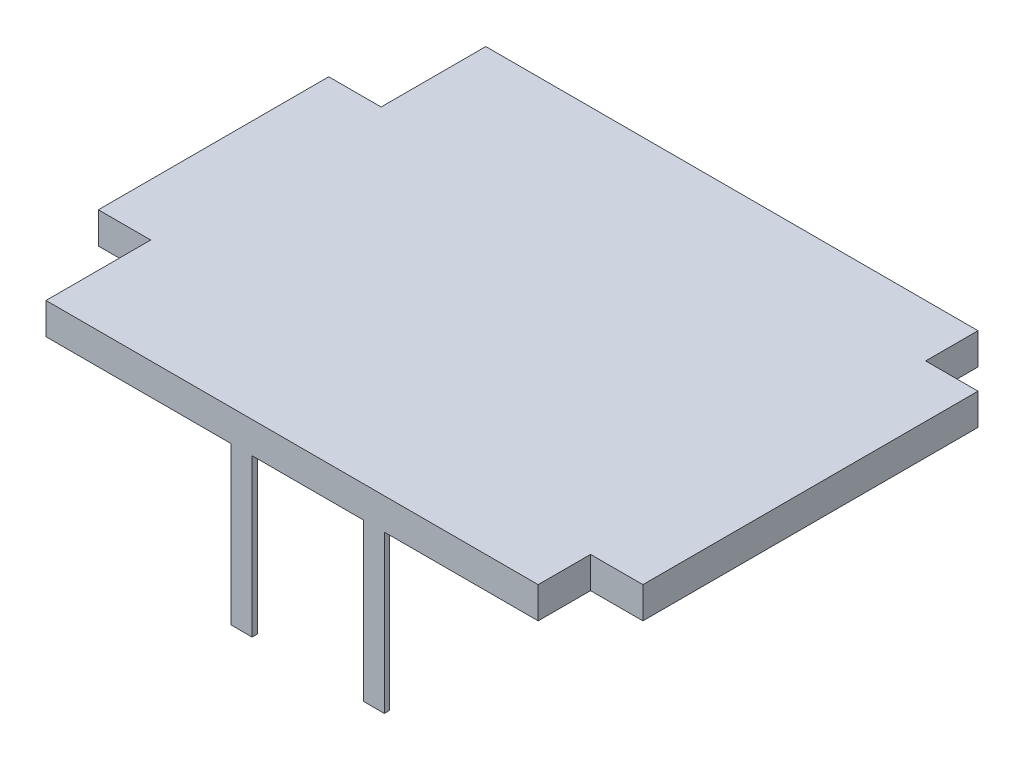
ISO-10303-21;
HEADER;
FILE_DESCRIPTION(('STEP AP214'),'2;1');
FILE_NAME('part.step','',(''),(''),'','','');
FILE_SCHEMA(('AUTOMOTIVE_DESIGN { 1 0 10303 214 1 1 1 1 }'));
ENDSEC;
DATA;
#1=APPLICATION_CONTEXT('core data for automotive mechanical design processes');
#2=APPLICATION_PROTOCOL_DEFINITION('international standard','automotive_design',2000,#1);
#3=PRODUCT_CONTEXT('',#1,'mechanical');
#4=PRODUCT('Part','Part','',(#3));
#5=PRODUCT_RELATED_PRODUCT_CATEGORY('part','',(#4));
#6=PRODUCT_DEFINITION_FORMATION('','',#4);
#7=PRODUCT_DEFINITION_CONTEXT('part definition',#1,'design');
#8=PRODUCT_DEFINITION('design','',#6,#7);
#9=PRODUCT_DEFINITION_SHAPE('','',#8);
#10=(LENGTH_UNIT() NAMED_UNIT(*) SI_UNIT(.MILLI.,.METRE.));
#11=(NAMED_UNIT(*) PLANE_ANGLE_UNIT() SI_UNIT($,.RADIAN.));
#12=(NAMED_UNIT(*) SI_UNIT($,.STERADIAN.) SOLID_ANGLE_UNIT());
#13=UNCERTAINTY_MEASURE_WITH_UNIT(LENGTH_MEASURE(1.E-05),#10,'distance_accuracy_value','');
#14=(GEOMETRIC_REPRESENTATION_CONTEXT(3) GLOBAL_UNCERTAINTY_ASSIGNED_CONTEXT((#13)) GLOBAL_UNIT_ASSIGNED_CONTEXT((#10,
#11,#12)) REPRESENTATION_CONTEXT('',''));
#15=CARTESIAN_POINT('',(0.,0.,0.));
#16=DIRECTION('',(0.,0.,1.));
#17=DIRECTION('',(1.,0.,0.));
#18=AXIS2_PLACEMENT_3D('',#15,#16,#17);
#19=CARTESIAN_POINT('',(0.,0.,0.));
#20=DIRECTION('',(0.,1.,0.));
#21=DIRECTION('',(0.,0.,1.));
#22=AXIS2_PLACEMENT_3D('',#19,#20,#21);
#23=PLANE('',#22);
#24=DIRECTION('',(0.,0.,-1.));
#25=VECTOR('',#24,1.);
#26=CARTESIAN_POINT('',(3.53103903493144,0.,4.3));
#27=LINE('',#26,#25);
#28=CARTESIAN_POINT('',(3.53103903493144,0.,4.3));
#29=VERTEX_POINT('',#28);
#30=CARTESIAN_POINT('',(3.53103903493144,0.,4.25));
#31=VERTEX_POINT('',#30);
#32=EDGE_CURVE('E245',#29,#31,#27,.T.);
#33=ORIENTED_EDGE('',*,*,#32,.F.);
#34=DIRECTION('',(1.,0.,0.));
#35=VECTOR('',#34,1.);
#36=CARTESIAN_POINT('',(0.500000000000001,0.,4.3));
#37=LINE('',#36,#35);
#38=CARTESIAN_POINT('',(2.46790063359605,0.,4.3));
#39=VERTEX_POINT('',#38);
#40=EDGE_CURVE('E401',#39,#29,#37,.T.);
#41=ORIENTED_EDGE('',*,*,#40,.F.);
#42=DIRECTION('',(0.,0.,1.));
#43=VECTOR('',#42,1.);
#44=CARTESIAN_POINT('',(2.46790063359605,0.,4.25));
#45=LINE('',#44,#43);
#46=CARTESIAN_POINT('',(2.46790063359605,0.,4.25));
#47=VERTEX_POINT('',#46);
#48=EDGE_CURVE('E59',#47,#39,#45,.T.);
#49=ORIENTED_EDGE('',*,*,#48,.F.);
#50=DIRECTION('',(1.,0.,0.));
#51=VECTOR('',#50,1.);
#52=CARTESIAN_POINT('',(2.46790063359605,0.,4.25));
#53=LINE('',#52,#51);
#54=CARTESIAN_POINT('',(2.26790063359605,0.,4.25));
#55=VERTEX_POINT('',#54);
#56=EDGE_CURVE('E257',#55,#47,#53,.T.);
#57=ORIENTED_EDGE('',*,*,#56,.F.);
#58=DIRECTION('',(0.,0.,-1.));
#59=VECTOR('',#58,1.);
#60=CARTESIAN_POINT('',(2.26790063359605,0.,4.25));
#61=LINE('',#60,#59);
#62=CARTESIAN_POINT('',(2.26790063359605,0.,4.3));
#63=VERTEX_POINT('',#62);
#64=EDGE_CURVE('E248',#63,#55,#61,.T.);
#65=ORIENTED_EDGE('',*,*,#64,.F.);
#66=CARTESIAN_POINT('',(0.500000000000001,0.,4.3));
#67=VERTEX_POINT('',#66);
#68=EDGE_CURVE('E398',#67,#63,#37,.T.);
#69=ORIENTED_EDGE('',*,*,#68,.F.);
#70=DIRECTION('',(0.,0.,1.));
#71=VECTOR('',#70,1.);
#72=CARTESIAN_POINT('',(0.5,0.,3.3));
#73=LINE('',#72,#71);
#74=CARTESIAN_POINT('',(0.5,0.,3.3));
#75=VERTEX_POINT('',#74);
#76=EDGE_CURVE('E390',#75,#67,#73,.T.);
#77=ORIENTED_EDGE('',*,*,#76,.F.);
#78=DIRECTION('',(1.,0.,0.));
#79=VECTOR('',#78,1.);
#80=CARTESIAN_POINT('',(0.,0.,3.3));
#81=LINE('',#80,#79);
#82=CARTESIAN_POINT('',(0.,0.,3.3));
#83=VERTEX_POINT('',#82);
#84=EDGE_CURVE('E395',#83,#75,#81,.T.);
#85=ORIENTED_EDGE('',*,*,#84,.F.);
#86=DIRECTION('',(0.,0.,1.));
#87=VECTOR('',#86,1.);
#88=CARTESIAN_POINT('',(0.,0.,1.1));
#89=LINE('',#88,#87);
#90=CARTESIAN_POINT('',(0.,0.,1.1));
#91=VERTEX_POINT('',#90);
#92=EDGE_CURVE('E324',#91,#83,#89,.T.);
#93=ORIENTED_EDGE('',*,*,#92,.F.);
#94=DIRECTION('',(1.,0.,0.));
#95=VECTOR('',#94,1.);
#96=CARTESIAN_POINT('',(0.,0.,1.1));
#97=LINE('',#96,#95);
#98=CARTESIAN_POINT('',(0.5,0.,1.1));
#99=VERTEX_POINT('',#98);
#100=EDGE_CURVE('E347',#91,#99,#97,.T.);
#101=ORIENTED_EDGE('',*,*,#100,.T.);
#102=DIRECTION('',(0.,0.,-1.));
#103=VECTOR('',#102,1.);
#104=CARTESIAN_POINT('',(0.5,0.,1.1));
#105=LINE('',#104,#103);
#106=CARTESIAN_POINT('',(0.5,0.,0.1));
#107=VERTEX_POINT('',#106);
#108=EDGE_CURVE('E344',#99,#107,#105,.T.);
#109=ORIENTED_EDGE('',*,*,#108,.T.);
#110=DIRECTION('',(1.,0.,0.));
#111=VECTOR('',#110,1.);
#112=CARTESIAN_POINT('',(0.5,0.,0.1));
#113=LINE('',#112,#111);
#114=CARTESIAN_POINT('',(2.26790063359605,0.,0.1));
#115=VERTEX_POINT('',#114);
#116=EDGE_CURVE('E336',#107,#115,#113,.T.);
#117=ORIENTED_EDGE('',*,*,#116,.T.);
#118=DIRECTION('',(0.,0.,-1.));
#119=VECTOR('',#118,1.);
#120=CARTESIAN_POINT('',(2.26790063359605,0.,0.15));
#121=LINE('',#120,#119);
#122=CARTESIAN_POINT('',(2.26790063359605,0.,0.15));
#123=VERTEX_POINT('',#122);
#124=EDGE_CURVE('E325',#123,#115,#121,.T.);
#125=ORIENTED_EDGE('',*,*,#124,.F.);
#126=DIRECTION('',(1.,0.,0.));
#127=VECTOR('',#126,1.);
#128=CARTESIAN_POINT('',(3.73103903493144,0.,0.15));
#129=LINE('',#128,#127);
#130=CARTESIAN_POINT('',(3.73103903493144,0.,0.15));
#131=VERTEX_POINT('',#130);
#132=EDGE_CURVE('E296',#123,#131,#129,.T.);
#133=ORIENTED_EDGE('',*,*,#132,.T.);
#134=DIRECTION('',(0.,0.,-1.));
#135=VECTOR('',#134,1.);
#136=CARTESIAN_POINT('',(3.73103903493144,0.,0.15));
#137=LINE('',#136,#135);
#138=CARTESIAN_POINT('',(3.73103903493144,0.,0.1));
#139=VERTEX_POINT('',#138);
#140=EDGE_CURVE('E320',#131,#139,#137,.T.);
#141=ORIENTED_EDGE('',*,*,#140,.T.);
#142=CARTESIAN_POINT('',(5.2,0.,0.1));
#143=VERTEX_POINT('',#142);
#144=EDGE_CURVE('E345',#139,#143,#113,.T.);
#145=ORIENTED_EDGE('',*,*,#144,.T.);
#146=DIRECTION('',(0.,0.,1.));
#147=VECTOR('',#146,1.);
#148=CARTESIAN_POINT('',(5.2,0.,0.1));
#149=LINE('',#148,#147);
#150=CARTESIAN_POINT('',(5.2,0.,0.6));
#151=VERTEX_POINT('',#150);
#152=EDGE_CURVE('E349',#143,#151,#149,.T.);
#153=ORIENTED_EDGE('',*,*,#152,.T.);
#154=DIRECTION('',(-1.,0.,0.));
#155=VECTOR('',#154,1.);
#156=CARTESIAN_POINT('',(5.7,0.,0.6));
#157=LINE('',#156,#155);
#158=CARTESIAN_POINT('',(5.7,0.,0.6));
#159=VERTEX_POINT('',#158);
#160=EDGE_CURVE('E414',#159,#151,#157,.T.);
#161=ORIENTED_EDGE('',*,*,#160,.F.);
#162=DIRECTION('',(0.,0.,1.));
#163=VECTOR('',#162,1.);
#164=CARTESIAN_POINT('',(5.7,0.,0.6));
#165=LINE('',#164,#163);
#166=CARTESIAN_POINT('',(5.7,0.,3.8));
#167=VERTEX_POINT('',#166);
#168=EDGE_CURVE('E412',#159,#167,#165,.T.);
#169=ORIENTED_EDGE('',*,*,#168,.T.);
#170=DIRECTION('',(-1.,0.,0.));
#171=VECTOR('',#170,1.);
#172=CARTESIAN_POINT('',(5.7,0.,3.8));
#173=LINE('',#172,#171);
#174=CARTESIAN_POINT('',(5.2,0.,3.8));
#175=VERTEX_POINT('',#174);
#176=EDGE_CURVE('E409',#167,#175,#173,.T.);
#177=ORIENTED_EDGE('',*,*,#176,.T.);
#178=DIRECTION('',(0.,0.,-1.));
#179=VECTOR('',#178,1.);
#180=CARTESIAN_POINT('',(5.2,0.,4.3));
#181=LINE('',#180,#179);
#182=CARTESIAN_POINT('',(5.2,0.,4.3));
#183=VERTEX_POINT('',#182);
#184=EDGE_CURVE('E406',#183,#175,#181,.T.);
#185=ORIENTED_EDGE('',*,*,#184,.F.);
#186=CARTESIAN_POINT('',(3.73103903493144,0.,4.3));
#187=VERTEX_POINT('',#186);
#188=EDGE_CURVE('E399',#187,#183,#37,.T.);
#189=ORIENTED_EDGE('',*,*,#188,.F.);
#190=DIRECTION('',(0.,0.,1.));
#191=VECTOR('',#190,1.);
#192=CARTESIAN_POINT('',(3.73103903493144,0.,4.3));
#193=LINE('',#192,#191);
#194=CARTESIAN_POINT('',(3.73103903493144,0.,4.25));
#195=VERTEX_POINT('',#194);
#196=EDGE_CURVE('E241',#195,#187,#193,.T.);
#197=ORIENTED_EDGE('',*,*,#196,.F.);
#198=DIRECTION('',(1.,0.,0.));
#199=VECTOR('',#198,1.);
#200=CARTESIAN_POINT('',(3.53103903493144,0.,4.25));
#201=LINE('',#200,#199);
#202=EDGE_CURVE('E503',#31,#195,#201,.T.);
#203=ORIENTED_EDGE('',*,*,#202,.F.);
#204=EDGE_LOOP('',(#33,#41,#49,#57,#65,#69,#77,#85,#93,#101,#109,#117,#125,#133,#141,#145,#153,
#161,#169,#177,#185,#189,#197,#203));
#205=FACE_BOUND('',#204,.T.);
#206=ADVANCED_FACE('F34',(#205),#23,.F.);
#207=CARTESIAN_POINT('',(0.,0.3,1.1));
#208=DIRECTION('',(1.,0.,0.));
#209=DIRECTION('',(0.,0.,-1.));
#210=AXIS2_PLACEMENT_3D('',#207,#208,#209);
#211=PLANE('',#210);
#212=ORIENTED_EDGE('',*,*,#92,.T.);
#213=DIRECTION('',(0.,-1.,0.));
#214=VECTOR('',#213,1.);
#215=CARTESIAN_POINT('',(0.,0.3,3.3));
#216=LINE('',#215,#214);
#217=CARTESIAN_POINT('',(0.,0.3,3.3));
#218=VERTEX_POINT('',#217);
#219=EDGE_CURVE('E11',#218,#83,#216,.T.);
#220=ORIENTED_EDGE('',*,*,#219,.F.);
#221=DIRECTION('',(0.,0.,1.));
#222=VECTOR('',#221,1.);
#223=CARTESIAN_POINT('',(0.,0.3,1.1));
#224=LINE('',#223,#222);
#225=CARTESIAN_POINT('',(0.,0.3,1.1));
#226=VERTEX_POINT('',#225);
#227=EDGE_CURVE('E359',#226,#218,#224,.T.);
#228=ORIENTED_EDGE('',*,*,#227,.F.);
#229=DIRECTION('',(0.,-1.,0.));
#230=VECTOR('',#229,1.);
#231=CARTESIAN_POINT('',(0.,0.3,1.1));
#232=LINE('',#231,#230);
#233=EDGE_CURVE('E360',#226,#91,#232,.T.);
#234=ORIENTED_EDGE('',*,*,#233,.T.);
#235=EDGE_LOOP('',(#212,#220,#228,#234));
#236=FACE_BOUND('',#235,.T.);
#237=ADVANCED_FACE('F36',(#236),#211,.F.);
#238=CARTESIAN_POINT('',(0.,0.3,3.3));
#239=DIRECTION('',(0.,0.,-1.));
#240=DIRECTION('',(-1.,0.,0.));
#241=AXIS2_PLACEMENT_3D('',#238,#239,#240);
#242=PLANE('',#241);
#243=ORIENTED_EDGE('',*,*,#84,.T.);
#244=DIRECTION('',(0.,-1.,0.));
#245=VECTOR('',#244,1.);
#246=CARTESIAN_POINT('',(0.5,0.3,3.3));
#247=LINE('',#246,#245);
#248=CARTESIAN_POINT('',(0.5,0.3,3.3));
#249=VERTEX_POINT('',#248);
#250=EDGE_CURVE('E43',#249,#75,#247,.T.);
#251=ORIENTED_EDGE('',*,*,#250,.F.);
#252=DIRECTION('',(1.,0.,0.));
#253=VECTOR('',#252,1.);
#254=CARTESIAN_POINT('',(0.,0.3,3.3));
#255=LINE('',#254,#253);
#256=EDGE_CURVE('E467',#218,#249,#255,.T.);
#257=ORIENTED_EDGE('',*,*,#256,.F.);
#258=ORIENTED_EDGE('',*,*,#219,.T.);
#259=EDGE_LOOP('',(#243,#251,#257,#258));
#260=FACE_BOUND('',#259,.T.);
#261=ADVANCED_FACE('F526',(#260),#242,.F.);
#262=CARTESIAN_POINT('',(0.5,0.3,3.3));
#263=DIRECTION('',(1.,0.,0.));
#264=DIRECTION('',(0.,0.,-1.));
#265=AXIS2_PLACEMENT_3D('',#262,#263,#264);
#266=PLANE('',#265);
#267=ORIENTED_EDGE('',*,*,#76,.T.);
#268=DIRECTION('',(0.,-1.,0.));
#269=VECTOR('',#268,1.);
#270=CARTESIAN_POINT('',(0.500000000000001,0.3,4.3));
#271=LINE('',#270,#269);
#272=CARTESIAN_POINT('',(0.500000000000001,0.3,4.3));
#273=VERTEX_POINT('',#272);
#274=EDGE_CURVE('E381',#273,#67,#271,.T.);
#275=ORIENTED_EDGE('',*,*,#274,.F.);
#276=DIRECTION('',(0.,0.,1.));
#277=VECTOR('',#276,1.);
#278=CARTESIAN_POINT('',(0.5,0.3,3.3));
#279=LINE('',#278,#277);
#280=EDGE_CURVE('E391',#249,#273,#279,.T.);
#281=ORIENTED_EDGE('',*,*,#280,.F.);
#282=ORIENTED_EDGE('',*,*,#250,.T.);
#283=EDGE_LOOP('',(#267,#275,#281,#282));
#284=FACE_BOUND('',#283,.T.);
#285=ADVANCED_FACE('F388',(#284),#266,.F.);
#286=CARTESIAN_POINT('',(0.500000000000001,0.3,4.3));
#287=DIRECTION('',(0.,0.,-1.));
#288=DIRECTION('',(-1.,0.,0.));
#289=AXIS2_PLACEMENT_3D('',#286,#287,#288);
#290=PLANE('',#289);
#291=ORIENTED_EDGE('',*,*,#68,.T.);
#292=DIRECTION('',(0.,1.,0.));
#293=VECTOR('',#292,1.);
#294=CARTESIAN_POINT('',(2.26790063359605,-1.5,4.3));
#295=LINE('',#294,#293);
#296=CARTESIAN_POINT('',(2.26790063359605,-1.5,4.3));
#297=VERTEX_POINT('',#296);
#298=EDGE_CURVE('E270',#297,#63,#295,.T.);
#299=ORIENTED_EDGE('',*,*,#298,.F.);
#300=DIRECTION('',(-1.,0.,0.));
#301=VECTOR('',#300,1.);
#302=CARTESIAN_POINT('',(2.46790063359605,-1.5,4.3));
#303=LINE('',#302,#301);
#304=CARTESIAN_POINT('',(2.46790063359605,-1.5,4.3));
#305=VERTEX_POINT('',#304);
#306=EDGE_CURVE('E256',#305,#297,#303,.T.);
#307=ORIENTED_EDGE('',*,*,#306,.F.);
#308=DIRECTION('',(0.,1.,0.));
#309=VECTOR('',#308,1.);
#310=CARTESIAN_POINT('',(2.46790063359605,-1.5,4.3));
#311=LINE('',#310,#309);
#312=EDGE_CURVE('E272',#305,#39,#311,.T.);
#313=ORIENTED_EDGE('',*,*,#312,.T.);
#314=ORIENTED_EDGE('',*,*,#40,.T.);
#315=DIRECTION('',(0.,1.,0.));
#316=VECTOR('',#315,1.);
#317=CARTESIAN_POINT('',(3.53103903493144,-1.5,4.3));
#318=LINE('',#317,#316);
#319=CARTESIAN_POINT('',(3.53103903493144,-1.5,4.3));
#320=VERTEX_POINT('',#319);
#321=EDGE_CURVE('E510',#320,#29,#318,.T.);
#322=ORIENTED_EDGE('',*,*,#321,.F.);
#323=DIRECTION('',(-1.,0.,0.));
#324=VECTOR('',#323,1.);
#325=CARTESIAN_POINT('',(3.53103903493144,-1.5,4.3));
#326=LINE('',#325,#324);
#327=CARTESIAN_POINT('',(3.73103903493144,-1.5,4.3));
#328=VERTEX_POINT('',#327);
#329=EDGE_CURVE('E238',#328,#320,#326,.T.);
#330=ORIENTED_EDGE('',*,*,#329,.F.);
#331=DIRECTION('',(0.,1.,0.));
#332=VECTOR('',#331,1.);
#333=CARTESIAN_POINT('',(3.73103903493144,-1.5,4.3));
#334=LINE('',#333,#332);
#335=EDGE_CURVE('E51',#328,#187,#334,.T.);
#336=ORIENTED_EDGE('',*,*,#335,.T.);
#337=ORIENTED_EDGE('',*,*,#188,.T.);
#338=DIRECTION('',(0.,-1.,0.));
#339=VECTOR('',#338,1.);
#340=CARTESIAN_POINT('',(5.2,0.3,4.3));
#341=LINE('',#340,#339);
#342=CARTESIAN_POINT('',(5.2,0.3,4.3));
#343=VERTEX_POINT('',#342);
#344=EDGE_CURVE('E378',#343,#183,#341,.T.);
#345=ORIENTED_EDGE('',*,*,#344,.F.);
#346=DIRECTION('',(1.,0.,0.));
#347=VECTOR('',#346,1.);
#348=CARTESIAN_POINT('',(0.500000000000001,0.3,4.3));
#349=LINE('',#348,#347);
#350=EDGE_CURVE('E474',#273,#343,#349,.T.);
#351=ORIENTED_EDGE('',*,*,#350,.F.);
#352=ORIENTED_EDGE('',*,*,#274,.T.);
#353=EDGE_LOOP('',(#291,#299,#307,#313,#314,#322,#330,#336,#337,#345,#351,#352));
#354=FACE_BOUND('',#353,.T.);
#355=ADVANCED_FACE('F488',(#354),#290,.F.);
#356=CARTESIAN_POINT('',(5.2,0.3,4.3));
#357=DIRECTION('',(-1.,0.,0.));
#358=DIRECTION('',(0.,0.,1.));
#359=AXIS2_PLACEMENT_3D('',#356,#357,#358);
#360=PLANE('',#359);
#361=ORIENTED_EDGE('',*,*,#184,.T.);
#362=DIRECTION('',(0.,-1.,0.));
#363=VECTOR('',#362,1.);
#364=CARTESIAN_POINT('',(5.2,0.3,3.8));
#365=LINE('',#364,#363);
#366=CARTESIAN_POINT('',(5.2,0.3,3.8));
#367=VERTEX_POINT('',#366);
#368=EDGE_CURVE('E376',#367,#175,#365,.T.);
#369=ORIENTED_EDGE('',*,*,#368,.F.);
#370=DIRECTION('',(0.,0.,-1.));
#371=VECTOR('',#370,1.);
#372=CARTESIAN_POINT('',(5.2,0.3,4.3));
#373=LINE('',#372,#371);
#374=EDGE_CURVE('E443',#343,#367,#373,.T.);
#375=ORIENTED_EDGE('',*,*,#374,.F.);
#376=ORIENTED_EDGE('',*,*,#344,.T.);
#377=EDGE_LOOP('',(#361,#369,#375,#376));
#378=FACE_BOUND('',#377,.T.);
#379=ADVANCED_FACE('F480',(#378),#360,.F.);
#380=CARTESIAN_POINT('',(5.7,0.3,3.8));
#381=DIRECTION('',(0.,0.,1.));
#382=DIRECTION('',(1.,0.,0.));
#383=AXIS2_PLACEMENT_3D('',#380,#381,#382);
#384=PLANE('',#383);
#385=ORIENTED_EDGE('',*,*,#176,.F.);
#386=DIRECTION('',(0.,-1.,0.));
#387=VECTOR('',#386,1.);
#388=CARTESIAN_POINT('',(5.7,0.3,3.8));
#389=LINE('',#388,#387);
#390=CARTESIAN_POINT('',(5.7,0.3,3.8));
#391=VERTEX_POINT('',#390);
#392=EDGE_CURVE('E374',#391,#167,#389,.T.);
#393=ORIENTED_EDGE('',*,*,#392,.F.);
#394=DIRECTION('',(-1.,0.,0.));
#395=VECTOR('',#394,1.);
#396=CARTESIAN_POINT('',(5.7,0.3,3.8));
#397=LINE('',#396,#395);
#398=EDGE_CURVE('E440',#391,#367,#397,.T.);
#399=ORIENTED_EDGE('',*,*,#398,.T.);
#400=ORIENTED_EDGE('',*,*,#368,.T.);
#401=EDGE_LOOP('',(#385,#393,#399,#400));
#402=FACE_BOUND('',#401,.T.);
#403=ADVANCED_FACE('F484',(#402),#384,.T.);
#404=CARTESIAN_POINT('',(5.7,0.3,0.6));
#405=DIRECTION('',(1.,0.,0.));
#406=DIRECTION('',(0.,0.,-1.));
#407=AXIS2_PLACEMENT_3D('',#404,#405,#406);
#408=PLANE('',#407);
#409=ORIENTED_EDGE('',*,*,#168,.F.);
#410=DIRECTION('',(0.,-1.,0.));
#411=VECTOR('',#410,1.);
#412=CARTESIAN_POINT('',(5.7,0.3,0.6));
#413=LINE('',#412,#411);
#414=CARTESIAN_POINT('',(5.7,0.3,0.6));
#415=VERTEX_POINT('',#414);
#416=EDGE_CURVE('E372',#415,#159,#413,.T.);
#417=ORIENTED_EDGE('',*,*,#416,.F.);
#418=DIRECTION('',(0.,0.,1.));
#419=VECTOR('',#418,1.);
#420=CARTESIAN_POINT('',(5.7,0.3,0.6));
#421=LINE('',#420,#419);
#422=EDGE_CURVE('E433',#415,#391,#421,.T.);
#423=ORIENTED_EDGE('',*,*,#422,.T.);
#424=ORIENTED_EDGE('',*,*,#392,.T.);
#425=EDGE_LOOP('',(#409,#417,#423,#424));
#426=FACE_BOUND('',#425,.T.);
#427=ADVANCED_FACE('F485',(#426),#408,.T.);
#428=CARTESIAN_POINT('',(5.7,0.3,0.6));
#429=DIRECTION('',(0.,0.,1.));
#430=DIRECTION('',(1.,0.,0.));
#431=AXIS2_PLACEMENT_3D('',#428,#429,#430);
#432=PLANE('',#431);
#433=ORIENTED_EDGE('',*,*,#160,.T.);
#434=DIRECTION('',(0.,-1.,0.));
#435=VECTOR('',#434,1.);
#436=CARTESIAN_POINT('',(5.2,0.3,0.6));
#437=LINE('',#436,#435);
#438=CARTESIAN_POINT('',(5.2,0.3,0.6));
#439=VERTEX_POINT('',#438);
#440=EDGE_CURVE('E370',#439,#151,#437,.T.);
#441=ORIENTED_EDGE('',*,*,#440,.F.);
#442=DIRECTION('',(-1.,0.,0.));
#443=VECTOR('',#442,1.);
#444=CARTESIAN_POINT('',(5.7,0.3,0.6));
#445=LINE('',#444,#443);
#446=EDGE_CURVE('E430',#415,#439,#445,.T.);
#447=ORIENTED_EDGE('',*,*,#446,.F.);
#448=ORIENTED_EDGE('',*,*,#416,.T.);
#449=EDGE_LOOP('',(#433,#441,#447,#448));
#450=FACE_BOUND('',#449,.T.);
#451=ADVANCED_FACE('F429',(#450),#432,.F.);
#452=CARTESIAN_POINT('',(5.2,0.3,0.1));
#453=DIRECTION('',(1.,0.,0.));
#454=DIRECTION('',(0.,0.,-1.));
#455=AXIS2_PLACEMENT_3D('',#452,#453,#454);
#456=PLANE('',#455);
#457=ORIENTED_EDGE('',*,*,#152,.F.);
#458=DIRECTION('',(0.,-1.,0.));
#459=VECTOR('',#458,1.);
#460=CARTESIAN_POINT('',(5.2,0.3,0.1));
#461=LINE('',#460,#459);
#462=CARTESIAN_POINT('',(5.2,0.3,0.1));
#463=VERTEX_POINT('',#462);
#464=EDGE_CURVE('E367',#463,#143,#461,.T.);
#465=ORIENTED_EDGE('',*,*,#464,.F.);
#466=DIRECTION('',(0.,0.,1.));
#467=VECTOR('',#466,1.);
#468=CARTESIAN_POINT('',(5.2,0.3,0.1));
#469=LINE('',#468,#467);
#470=EDGE_CURVE('E427',#463,#439,#469,.T.);
#471=ORIENTED_EDGE('',*,*,#470,.T.);
#472=ORIENTED_EDGE('',*,*,#440,.T.);
#473=EDGE_LOOP('',(#457,#465,#471,#472));
#474=FACE_BOUND('',#473,.T.);
#475=ADVANCED_FACE('F424',(#474),#456,.T.);
#476=CARTESIAN_POINT('',(0.5,0.3,0.1));
#477=DIRECTION('',(0.,0.,-1.));
#478=DIRECTION('',(-1.,0.,0.));
#479=AXIS2_PLACEMENT_3D('',#476,#477,#478);
#480=PLANE('',#479);
#481=ORIENTED_EDGE('',*,*,#116,.F.);
#482=DIRECTION('',(0.,-1.,0.));
#483=VECTOR('',#482,1.);
#484=CARTESIAN_POINT('',(0.5,0.3,0.1));
#485=LINE('',#484,#483);
#486=CARTESIAN_POINT('',(0.5,0.3,0.1));
#487=VERTEX_POINT('',#486);
#488=EDGE_CURVE('E365',#487,#107,#485,.T.);
#489=ORIENTED_EDGE('',*,*,#488,.F.);
#490=DIRECTION('',(1.,0.,0.));
#491=VECTOR('',#490,1.);
#492=CARTESIAN_POINT('',(0.5,0.3,0.1));
#493=LINE('',#492,#491);
#494=EDGE_CURVE('E448',#487,#463,#493,.T.);
#495=ORIENTED_EDGE('',*,*,#494,.T.);
#496=ORIENTED_EDGE('',*,*,#464,.T.);
#497=ORIENTED_EDGE('',*,*,#144,.F.);
#498=DIRECTION('',(0.,-1.,0.));
#499=VECTOR('',#498,1.);
#500=CARTESIAN_POINT('',(3.73103903493144,0.,0.1));
#501=LINE('',#500,#499);
#502=CARTESIAN_POINT('',(3.73103903493144,-1.5,0.1));
#503=VERTEX_POINT('',#502);
#504=EDGE_CURVE('E274',#139,#503,#501,.T.);
#505=ORIENTED_EDGE('',*,*,#504,.T.);
#506=DIRECTION('',(-1.,0.,0.));
#507=VECTOR('',#506,1.);
#508=CARTESIAN_POINT('',(3.53103903493144,-1.5,0.1));
#509=LINE('',#508,#507);
#510=CARTESIAN_POINT('',(3.53103903493144,-1.5,0.1));
#511=VERTEX_POINT('',#510);
#512=EDGE_CURVE('E300',#503,#511,#509,.T.);
#513=ORIENTED_EDGE('',*,*,#512,.T.);
#514=DIRECTION('',(0.,1.,0.));
#515=VECTOR('',#514,1.);
#516=CARTESIAN_POINT('',(3.53103903493144,-1.5,0.1));
#517=LINE('',#516,#515);
#518=CARTESIAN_POINT('',(3.53103903493144,-0.2,0.1));
#519=VERTEX_POINT('',#518);
#520=EDGE_CURVE('E303',#511,#519,#517,.T.);
#521=ORIENTED_EDGE('',*,*,#520,.T.);
#522=DIRECTION('',(-1.,0.,0.));
#523=VECTOR('',#522,1.);
#524=CARTESIAN_POINT('',(3.53103903493144,-0.2,0.1));
#525=LINE('',#524,#523);
#526=CARTESIAN_POINT('',(2.46790063359605,-0.2,0.1));
#527=VERTEX_POINT('',#526);
#528=EDGE_CURVE('E306',#519,#527,#525,.T.);
#529=ORIENTED_EDGE('',*,*,#528,.T.);
#530=DIRECTION('',(0.,-1.,0.));
#531=VECTOR('',#530,1.);
#532=CARTESIAN_POINT('',(2.46790063359605,-0.2,0.1));
#533=LINE('',#532,#531);
#534=CARTESIAN_POINT('',(2.46790063359605,-1.5,0.1));
#535=VERTEX_POINT('',#534);
#536=EDGE_CURVE('E309',#527,#535,#533,.T.);
#537=ORIENTED_EDGE('',*,*,#536,.T.);
#538=DIRECTION('',(-1.,0.,0.));
#539=VECTOR('',#538,1.);
#540=CARTESIAN_POINT('',(2.26790063359605,-1.5,0.1));
#541=LINE('',#540,#539);
#542=CARTESIAN_POINT('',(2.26790063359605,-1.5,0.1));
#543=VERTEX_POINT('',#542);
#544=EDGE_CURVE('E312',#535,#543,#541,.T.);
#545=ORIENTED_EDGE('',*,*,#544,.T.);
#546=DIRECTION('',(0.,1.,0.));
#547=VECTOR('',#546,1.);
#548=CARTESIAN_POINT('',(2.26790063359605,0.,0.1));
#549=LINE('',#548,#547);
#550=EDGE_CURVE('E279',#543,#115,#549,.T.);
#551=ORIENTED_EDGE('',*,*,#550,.T.);
#552=EDGE_LOOP('',(#481,#489,#495,#496,#497,#505,#513,#521,#529,#537,#545,#551));
#553=FACE_BOUND('',#552,.T.);
#554=ADVANCED_FACE('F335',(#553),#480,.T.);
#555=CARTESIAN_POINT('',(0.5,0.3,1.1));
#556=DIRECTION('',(-1.,0.,0.));
#557=DIRECTION('',(0.,0.,1.));
#558=AXIS2_PLACEMENT_3D('',#555,#556,#557);
#559=PLANE('',#558);
#560=ORIENTED_EDGE('',*,*,#108,.F.);
#561=DIRECTION('',(0.,-1.,0.));
#562=VECTOR('',#561,1.);
#563=CARTESIAN_POINT('',(0.5,0.3,1.1));
#564=LINE('',#563,#562);
#565=CARTESIAN_POINT('',(0.5,0.3,1.1));
#566=VERTEX_POINT('',#565);
#567=EDGE_CURVE('E362',#566,#99,#564,.T.);
#568=ORIENTED_EDGE('',*,*,#567,.F.);
#569=DIRECTION('',(0.,0.,-1.));
#570=VECTOR('',#569,1.);
#571=CARTESIAN_POINT('',(0.5,0.3,1.1));
#572=LINE('',#571,#570);
#573=EDGE_CURVE('E451',#566,#487,#572,.T.);
#574=ORIENTED_EDGE('',*,*,#573,.T.);
#575=ORIENTED_EDGE('',*,*,#488,.T.);
#576=EDGE_LOOP('',(#560,#568,#574,#575));
#577=FACE_BOUND('',#576,.T.);
#578=ADVANCED_FACE('F465',(#577),#559,.T.);
#579=CARTESIAN_POINT('',(0.,0.3,1.1));
#580=DIRECTION('',(0.,0.,-1.));
#581=DIRECTION('',(-1.,0.,0.));
#582=AXIS2_PLACEMENT_3D('',#579,#580,#581);
#583=PLANE('',#582);
#584=ORIENTED_EDGE('',*,*,#100,.F.);
#585=ORIENTED_EDGE('',*,*,#233,.F.);
#586=DIRECTION('',(1.,0.,0.));
#587=VECTOR('',#586,1.);
#588=CARTESIAN_POINT('',(0.,0.3,1.1));
#589=LINE('',#588,#587);
#590=EDGE_CURVE('E363',#226,#566,#589,.T.);
#591=ORIENTED_EDGE('',*,*,#590,.T.);
#592=ORIENTED_EDGE('',*,*,#567,.T.);
#593=EDGE_LOOP('',(#584,#585,#591,#592));
#594=FACE_BOUND('',#593,.T.);
#595=ADVANCED_FACE('F461',(#594),#583,.T.);
#596=CARTESIAN_POINT('',(0.,0.3,0.));
#597=DIRECTION('',(0.,1.,0.));
#598=DIRECTION('',(0.,0.,1.));
#599=AXIS2_PLACEMENT_3D('',#596,#597,#598);
#600=PLANE('',#599);
#601=ORIENTED_EDGE('',*,*,#227,.T.);
#602=ORIENTED_EDGE('',*,*,#256,.T.);
#603=ORIENTED_EDGE('',*,*,#280,.T.);
#604=ORIENTED_EDGE('',*,*,#350,.T.);
#605=ORIENTED_EDGE('',*,*,#374,.T.);
#606=ORIENTED_EDGE('',*,*,#398,.F.);
#607=ORIENTED_EDGE('',*,*,#422,.F.);
#608=ORIENTED_EDGE('',*,*,#446,.T.);
#609=ORIENTED_EDGE('',*,*,#470,.F.);
#610=ORIENTED_EDGE('',*,*,#494,.F.);
#611=ORIENTED_EDGE('',*,*,#573,.F.);
#612=ORIENTED_EDGE('',*,*,#590,.F.);
#613=EDGE_LOOP('',(#601,#602,#603,#604,#605,#606,#607,#608,#609,#610,#611,#612));
#614=FACE_BOUND('',#613,.T.);
#615=ADVANCED_FACE('F438',(#614),#600,.T.);
#616=CARTESIAN_POINT('',(3.73103903493144,0.,0.15));
#617=DIRECTION('',(1.,0.,0.));
#618=DIRECTION('',(0.,0.,-1.));
#619=AXIS2_PLACEMENT_3D('',#616,#617,#618);
#620=PLANE('',#619);
#621=ORIENTED_EDGE('',*,*,#504,.F.);
#622=ORIENTED_EDGE('',*,*,#140,.F.);
#623=DIRECTION('',(0.,-1.,0.));
#624=VECTOR('',#623,1.);
#625=CARTESIAN_POINT('',(3.73103903493144,0.,0.15));
#626=LINE('',#625,#624);
#627=CARTESIAN_POINT('',(3.73103903493144,-1.5,0.15));
#628=VERTEX_POINT('',#627);
#629=EDGE_CURVE('E275',#131,#628,#626,.T.);
#630=ORIENTED_EDGE('',*,*,#629,.T.);
#631=DIRECTION('',(0.,0.,-1.));
#632=VECTOR('',#631,1.);
#633=CARTESIAN_POINT('',(3.73103903493144,-1.5,0.15));
#634=LINE('',#633,#632);
#635=EDGE_CURVE('E299',#628,#503,#634,.T.);
#636=ORIENTED_EDGE('',*,*,#635,.T.);
#637=EDGE_LOOP('',(#621,#622,#630,#636));
#638=FACE_BOUND('',#637,.T.);
#639=ADVANCED_FACE('F603',(#638),#620,.T.);
#640=CARTESIAN_POINT('',(2.26790063359605,0.,0.15));
#641=DIRECTION('',(-1.,0.,0.));
#642=DIRECTION('',(0.,0.,1.));
#643=AXIS2_PLACEMENT_3D('',#640,#641,#642);
#644=PLANE('',#643);
#645=ORIENTED_EDGE('',*,*,#550,.F.);
#646=DIRECTION('',(0.,0.,-1.));
#647=VECTOR('',#646,1.);
#648=CARTESIAN_POINT('',(2.26790063359605,-1.5,0.15));
#649=LINE('',#648,#647);
#650=CARTESIAN_POINT('',(2.26790063359605,-1.5,0.15));
#651=VERTEX_POINT('',#650);
#652=EDGE_CURVE('E317',#651,#543,#649,.T.);
#653=ORIENTED_EDGE('',*,*,#652,.F.);
#654=DIRECTION('',(0.,1.,0.));
#655=VECTOR('',#654,1.);
#656=CARTESIAN_POINT('',(2.26790063359605,0.,0.15));
#657=LINE('',#656,#655);
#658=EDGE_CURVE('E294',#651,#123,#657,.T.);
#659=ORIENTED_EDGE('',*,*,#658,.T.);
#660=ORIENTED_EDGE('',*,*,#124,.T.);
#661=EDGE_LOOP('',(#645,#653,#659,#660));
#662=FACE_BOUND('',#661,.T.);
#663=ADVANCED_FACE('F607',(#662),#644,.T.);
#664=CARTESIAN_POINT('',(2.26790063359605,-1.5,0.15));
#665=DIRECTION('',(0.,-1.,0.));
#666=DIRECTION('',(0.,0.,-1.));
#667=AXIS2_PLACEMENT_3D('',#664,#665,#666);
#668=PLANE('',#667);
#669=ORIENTED_EDGE('',*,*,#544,.F.);
#670=DIRECTION('',(0.,0.,-1.));
#671=VECTOR('',#670,1.);
#672=CARTESIAN_POINT('',(2.46790063359605,-1.5,0.15));
#673=LINE('',#672,#671);
#674=CARTESIAN_POINT('',(2.46790063359605,-1.5,0.15));
#675=VERTEX_POINT('',#674);
#676=EDGE_CURVE('E795',#675,#535,#673,.T.);
#677=ORIENTED_EDGE('',*,*,#676,.F.);
#678=DIRECTION('',(-1.,0.,0.));
#679=VECTOR('',#678,1.);
#680=CARTESIAN_POINT('',(2.26790063359605,-1.5,0.15));
#681=LINE('',#680,#679);
#682=EDGE_CURVE('E291',#675,#651,#681,.T.);
#683=ORIENTED_EDGE('',*,*,#682,.T.);
#684=ORIENTED_EDGE('',*,*,#652,.T.);
#685=EDGE_LOOP('',(#669,#677,#683,#684));
#686=FACE_BOUND('',#685,.T.);
#687=ADVANCED_FACE('F614',(#686),#668,.T.);
#688=CARTESIAN_POINT('',(2.46790063359605,-0.2,0.15));
#689=DIRECTION('',(1.,0.,0.));
#690=DIRECTION('',(0.,0.,-1.));
#691=AXIS2_PLACEMENT_3D('',#688,#689,#690);
#692=PLANE('',#691);
#693=ORIENTED_EDGE('',*,*,#536,.F.);
#694=DIRECTION('',(0.,0.,-1.));
#695=VECTOR('',#694,1.);
#696=CARTESIAN_POINT('',(2.46790063359605,-0.2,0.15));
#697=LINE('',#696,#695);
#698=CARTESIAN_POINT('',(2.46790063359605,-0.2,0.15));
#699=VERTEX_POINT('',#698);
#700=EDGE_CURVE('E793',#699,#527,#697,.T.);
#701=ORIENTED_EDGE('',*,*,#700,.F.);
#702=DIRECTION('',(0.,-1.,0.));
#703=VECTOR('',#702,1.);
#704=CARTESIAN_POINT('',(2.46790063359605,-0.2,0.15));
#705=LINE('',#704,#703);
#706=EDGE_CURVE('E288',#699,#675,#705,.T.);
#707=ORIENTED_EDGE('',*,*,#706,.T.);
#708=ORIENTED_EDGE('',*,*,#676,.T.);
#709=EDGE_LOOP('',(#693,#701,#707,#708));
#710=FACE_BOUND('',#709,.T.);
#711=ADVANCED_FACE('F621',(#710),#692,.T.);
#712=CARTESIAN_POINT('',(3.53103903493144,-0.2,0.15));
#713=DIRECTION('',(0.,-1.,0.));
#714=DIRECTION('',(1.,0.,0.));
#715=AXIS2_PLACEMENT_3D('',#712,#713,#714);
#716=PLANE('',#715);
#717=ORIENTED_EDGE('',*,*,#528,.F.);
#718=DIRECTION('',(0.,0.,-1.));
#719=VECTOR('',#718,1.);
#720=CARTESIAN_POINT('',(3.53103903493144,-0.2,0.15));
#721=LINE('',#720,#719);
#722=CARTESIAN_POINT('',(3.53103903493144,-0.2,0.15));
#723=VERTEX_POINT('',#722);
#724=EDGE_CURVE('E789',#723,#519,#721,.T.);
#725=ORIENTED_EDGE('',*,*,#724,.F.);
#726=DIRECTION('',(-1.,0.,0.));
#727=VECTOR('',#726,1.);
#728=CARTESIAN_POINT('',(3.53103903493144,-0.2,0.15));
#729=LINE('',#728,#727);
#730=EDGE_CURVE('E285',#723,#699,#729,.T.);
#731=ORIENTED_EDGE('',*,*,#730,.T.);
#732=ORIENTED_EDGE('',*,*,#700,.T.);
#733=EDGE_LOOP('',(#717,#725,#731,#732));
#734=FACE_BOUND('',#733,.T.);
#735=ADVANCED_FACE('F629',(#734),#716,.T.);
#736=CARTESIAN_POINT('',(3.53103903493144,-1.5,0.15));
#737=DIRECTION('',(-1.,0.,0.));
#738=DIRECTION('',(0.,0.,1.));
#739=AXIS2_PLACEMENT_3D('',#736,#737,#738);
#740=PLANE('',#739);
#741=ORIENTED_EDGE('',*,*,#520,.F.);
#742=DIRECTION('',(0.,0.,-1.));
#743=VECTOR('',#742,1.);
#744=CARTESIAN_POINT('',(3.53103903493144,-1.5,0.15));
#745=LINE('',#744,#743);
#746=CARTESIAN_POINT('',(3.53103903493144,-1.5,0.15));
#747=VERTEX_POINT('',#746);
#748=EDGE_CURVE('E787',#747,#511,#745,.T.);
#749=ORIENTED_EDGE('',*,*,#748,.F.);
#750=DIRECTION('',(0.,1.,0.));
#751=VECTOR('',#750,1.);
#752=CARTESIAN_POINT('',(3.53103903493144,-1.5,0.15));
#753=LINE('',#752,#751);
#754=EDGE_CURVE('E282',#747,#723,#753,.T.);
#755=ORIENTED_EDGE('',*,*,#754,.T.);
#756=ORIENTED_EDGE('',*,*,#724,.T.);
#757=EDGE_LOOP('',(#741,#749,#755,#756));
#758=FACE_BOUND('',#757,.T.);
#759=ADVANCED_FACE('F637',(#758),#740,.T.);
#760=CARTESIAN_POINT('',(3.53103903493144,-1.5,0.15));
#761=DIRECTION('',(0.,-1.,0.));
#762=DIRECTION('',(0.,0.,-1.));
#763=AXIS2_PLACEMENT_3D('',#760,#761,#762);
#764=PLANE('',#763);
#765=ORIENTED_EDGE('',*,*,#512,.F.);
#766=ORIENTED_EDGE('',*,*,#635,.F.);
#767=DIRECTION('',(-1.,0.,0.));
#768=VECTOR('',#767,1.);
#769=CARTESIAN_POINT('',(3.53103903493144,-1.5,0.15));
#770=LINE('',#769,#768);
#771=EDGE_CURVE('E278',#628,#747,#770,.T.);
#772=ORIENTED_EDGE('',*,*,#771,.T.);
#773=ORIENTED_EDGE('',*,*,#748,.T.);
#774=EDGE_LOOP('',(#765,#766,#772,#773));
#775=FACE_BOUND('',#774,.T.);
#776=ADVANCED_FACE('F645',(#775),#764,.T.);
#777=CARTESIAN_POINT('',(0.,0.,0.15));
#778=DIRECTION('',(0.,0.,1.));
#779=DIRECTION('',(1.,0.,0.));
#780=AXIS2_PLACEMENT_3D('',#777,#778,#779);
#781=PLANE('',#780);
#782=ORIENTED_EDGE('',*,*,#629,.F.);
#783=ORIENTED_EDGE('',*,*,#132,.F.);
#784=ORIENTED_EDGE('',*,*,#658,.F.);
#785=ORIENTED_EDGE('',*,*,#682,.F.);
#786=ORIENTED_EDGE('',*,*,#706,.F.);
#787=ORIENTED_EDGE('',*,*,#730,.F.);
#788=ORIENTED_EDGE('',*,*,#754,.F.);
#789=ORIENTED_EDGE('',*,*,#771,.F.);
#790=EDGE_LOOP('',(#782,#783,#784,#785,#786,#787,#788,#789));
#791=FACE_BOUND('',#790,.T.);
#792=ADVANCED_FACE('F653',(#791),#781,.T.);
#793=CARTESIAN_POINT('',(2.46790063359605,-1.5,4.25));
#794=DIRECTION('',(-1.,0.,0.));
#795=DIRECTION('',(0.,0.,1.));
#796=AXIS2_PLACEMENT_3D('',#793,#794,#795);
#797=PLANE('',#796);
#798=ORIENTED_EDGE('',*,*,#48,.T.);
#799=ORIENTED_EDGE('',*,*,#312,.F.);
#800=DIRECTION('',(0.,0.,1.));
#801=VECTOR('',#800,1.);
#802=CARTESIAN_POINT('',(2.46790063359605,-1.5,4.25));
#803=LINE('',#802,#801);
#804=CARTESIAN_POINT('',(2.46790063359605,-1.5,4.25));
#805=VERTEX_POINT('',#804);
#806=EDGE_CURVE('E253',#805,#305,#803,.T.);
#807=ORIENTED_EDGE('',*,*,#806,.F.);
#808=DIRECTION('',(0.,1.,0.));
#809=VECTOR('',#808,1.);
#810=CARTESIAN_POINT('',(2.46790063359605,-1.5,4.25));
#811=LINE('',#810,#809);
#812=EDGE_CURVE('E262',#805,#47,#811,.T.);
#813=ORIENTED_EDGE('',*,*,#812,.T.);
#814=EDGE_LOOP('',(#798,#799,#807,#813));
#815=FACE_BOUND('',#814,.T.);
#816=ADVANCED_FACE('F499',(#815),#797,.F.);
#817=CARTESIAN_POINT('',(2.26790063359605,-1.5,4.25));
#818=DIRECTION('',(1.,0.,0.));
#819=DIRECTION('',(0.,0.,-1.));
#820=AXIS2_PLACEMENT_3D('',#817,#818,#819);
#821=PLANE('',#820);
#822=ORIENTED_EDGE('',*,*,#64,.T.);
#823=DIRECTION('',(0.,1.,0.));
#824=VECTOR('',#823,1.);
#825=CARTESIAN_POINT('',(2.26790063359605,-1.5,4.25));
#826=LINE('',#825,#824);
#827=CARTESIAN_POINT('',(2.26790063359605,-1.5,4.25));
#828=VERTEX_POINT('',#827);
#829=EDGE_CURVE('E267',#828,#55,#826,.T.);
#830=ORIENTED_EDGE('',*,*,#829,.F.);
#831=DIRECTION('',(0.,0.,-1.));
#832=VECTOR('',#831,1.);
#833=CARTESIAN_POINT('',(2.26790063359605,-1.5,4.25));
#834=LINE('',#833,#832);
#835=EDGE_CURVE('E259',#297,#828,#834,.T.);
#836=ORIENTED_EDGE('',*,*,#835,.F.);
#837=ORIENTED_EDGE('',*,*,#298,.T.);
#838=EDGE_LOOP('',(#822,#830,#836,#837));
#839=FACE_BOUND('',#838,.T.);
#840=ADVANCED_FACE('F493',(#839),#821,.F.);
#841=CARTESIAN_POINT('',(2.46790063359605,-1.5,4.25));
#842=DIRECTION('',(0.,0.,1.));
#843=DIRECTION('',(1.,0.,0.));
#844=AXIS2_PLACEMENT_3D('',#841,#842,#843);
#845=PLANE('',#844);
#846=ORIENTED_EDGE('',*,*,#56,.T.);
#847=ORIENTED_EDGE('',*,*,#812,.F.);
#848=DIRECTION('',(1.,0.,0.));
#849=VECTOR('',#848,1.);
#850=CARTESIAN_POINT('',(2.46790063359605,-1.5,4.25));
#851=LINE('',#850,#849);
#852=EDGE_CURVE('E261',#828,#805,#851,.T.);
#853=ORIENTED_EDGE('',*,*,#852,.F.);
#854=ORIENTED_EDGE('',*,*,#829,.T.);
#855=EDGE_LOOP('',(#846,#847,#853,#854));
#856=FACE_BOUND('',#855,.T.);
#857=ADVANCED_FACE('F673',(#856),#845,.F.);
#858=CARTESIAN_POINT('',(0.,-1.5,0.));
#859=DIRECTION('',(0.,-1.,0.));
#860=DIRECTION('',(0.,0.,-1.));
#861=AXIS2_PLACEMENT_3D('',#858,#859,#860);
#862=PLANE('',#861);
#863=ORIENTED_EDGE('',*,*,#806,.T.);
#864=ORIENTED_EDGE('',*,*,#306,.T.);
#865=ORIENTED_EDGE('',*,*,#835,.T.);
#866=ORIENTED_EDGE('',*,*,#852,.T.);
#867=EDGE_LOOP('',(#863,#864,#865,#866));
#868=FACE_BOUND('',#867,.T.);
#869=ADVANCED_FACE('F496',(#868),#862,.T.);
#870=CARTESIAN_POINT('',(3.53103903493144,-1.5,4.3));
#871=DIRECTION('',(1.,0.,0.));
#872=DIRECTION('',(0.,0.,-1.));
#873=AXIS2_PLACEMENT_3D('',#870,#871,#872);
#874=PLANE('',#873);
#875=ORIENTED_EDGE('',*,*,#32,.T.);
#876=DIRECTION('',(0.,1.,0.));
#877=VECTOR('',#876,1.);
#878=CARTESIAN_POINT('',(3.53103903493144,-1.5,4.25));
#879=LINE('',#878,#877);
#880=CARTESIAN_POINT('',(3.53103903493144,-1.5,4.25));
#881=VERTEX_POINT('',#880);
#882=EDGE_CURVE('E227',#881,#31,#879,.T.);
#883=ORIENTED_EDGE('',*,*,#882,.F.);
#884=DIRECTION('',(0.,0.,-1.));
#885=VECTOR('',#884,1.);
#886=CARTESIAN_POINT('',(3.53103903493144,-1.5,4.3));
#887=LINE('',#886,#885);
#888=EDGE_CURVE('E234',#320,#881,#887,.T.);
#889=ORIENTED_EDGE('',*,*,#888,.F.);
#890=ORIENTED_EDGE('',*,*,#321,.T.);
#891=EDGE_LOOP('',(#875,#883,#889,#890));
#892=FACE_BOUND('',#891,.T.);
#893=ADVANCED_FACE('F243',(#892),#874,.F.);
#894=CARTESIAN_POINT('',(3.53103903493144,-1.5,4.25));
#895=DIRECTION('',(0.,0.,1.));
#896=DIRECTION('',(1.,0.,0.));
#897=AXIS2_PLACEMENT_3D('',#894,#895,#896);
#898=PLANE('',#897);
#899=ORIENTED_EDGE('',*,*,#202,.T.);
#900=DIRECTION('',(0.,1.,0.));
#901=VECTOR('',#900,1.);
#902=CARTESIAN_POINT('',(3.73103903493144,-1.5,4.25));
#903=LINE('',#902,#901);
#904=CARTESIAN_POINT('',(3.73103903493144,-1.5,4.25));
#905=VERTEX_POINT('',#904);
#906=EDGE_CURVE('E230',#905,#195,#903,.T.);
#907=ORIENTED_EDGE('',*,*,#906,.F.);
#908=DIRECTION('',(1.,0.,0.));
#909=VECTOR('',#908,1.);
#910=CARTESIAN_POINT('',(3.53103903493144,-1.5,4.25));
#911=LINE('',#910,#909);
#912=EDGE_CURVE('E223',#881,#905,#911,.T.);
#913=ORIENTED_EDGE('',*,*,#912,.F.);
#914=ORIENTED_EDGE('',*,*,#882,.T.);
#915=EDGE_LOOP('',(#899,#907,#913,#914));
#916=FACE_BOUND('',#915,.T.);
#917=ADVANCED_FACE('F225',(#916),#898,.F.);
#918=CARTESIAN_POINT('',(3.73103903493144,-1.5,4.3));
#919=DIRECTION('',(-1.,0.,0.));
#920=DIRECTION('',(0.,0.,1.));
#921=AXIS2_PLACEMENT_3D('',#918,#919,#920);
#922=PLANE('',#921);
#923=ORIENTED_EDGE('',*,*,#196,.T.);
#924=ORIENTED_EDGE('',*,*,#335,.F.);
#925=DIRECTION('',(0.,0.,1.));
#926=VECTOR('',#925,1.);
#927=CARTESIAN_POINT('',(3.73103903493144,-1.5,4.3));
#928=LINE('',#927,#926);
#929=EDGE_CURVE('E233',#905,#328,#928,.T.);
#930=ORIENTED_EDGE('',*,*,#929,.F.);
#931=ORIENTED_EDGE('',*,*,#906,.T.);
#932=EDGE_LOOP('',(#923,#924,#930,#931));
#933=FACE_BOUND('',#932,.T.);
#934=ADVANCED_FACE('F512',(#933),#922,.F.);
#935=CARTESIAN_POINT('',(0.,-1.5,0.));
#936=DIRECTION('',(0.,-1.,0.));
#937=DIRECTION('',(0.,0.,-1.));
#938=AXIS2_PLACEMENT_3D('',#935,#936,#937);
#939=PLANE('',#938);
#940=ORIENTED_EDGE('',*,*,#888,.T.);
#941=ORIENTED_EDGE('',*,*,#912,.T.);
#942=ORIENTED_EDGE('',*,*,#929,.T.);
#943=ORIENTED_EDGE('',*,*,#329,.T.);
#944=EDGE_LOOP('',(#940,#941,#942,#943));
#945=FACE_BOUND('',#944,.T.);
#946=ADVANCED_FACE('F237',(#945),#939,.T.);
#947=CLOSED_SHELL('',(#206,#237,#261,#285,#355,#379,#403,#427,#451,#475,#554,#578,#595,#615,
#639,#663,#687,#711,#735,#759,#776,#792,#816,#840,#857,#869,#893,#917,#934,#946));
#948=MANIFOLD_SOLID_BREP('B2',#947);
#949=ADVANCED_BREP_SHAPE_REPRESENTATION('',(#18,#948),#14);
#950=SHAPE_DEFINITION_REPRESENTATION(#9,#949);
ENDSEC;
END-ISO-10303-21;
